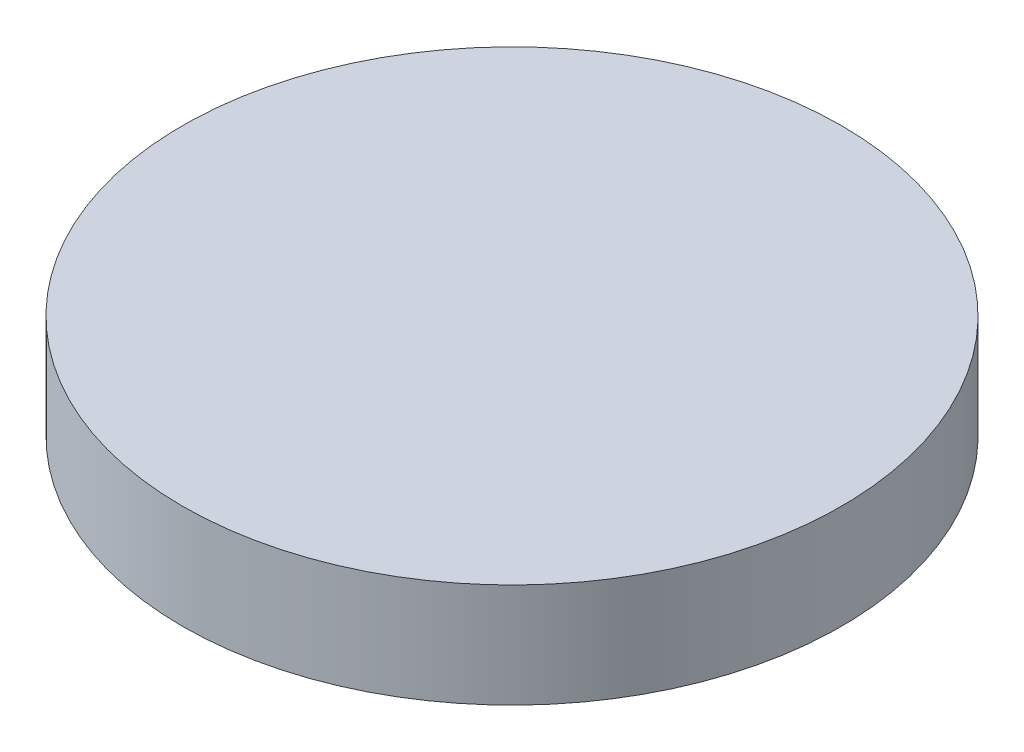
ISO-10303-21;
HEADER;
FILE_DESCRIPTION(('STEP AP214'),'2;1');
FILE_NAME('part.step','',(''),(''),'','','');
FILE_SCHEMA(('AUTOMOTIVE_DESIGN { 1 0 10303 214 1 1 1 1 }'));
ENDSEC;
DATA;
#1=APPLICATION_CONTEXT('core data for automotive mechanical design processes');
#2=APPLICATION_PROTOCOL_DEFINITION('international standard','automotive_design',2000,#1);
#3=PRODUCT_CONTEXT('',#1,'mechanical');
#4=PRODUCT('Part','Part','',(#3));
#5=PRODUCT_RELATED_PRODUCT_CATEGORY('part','',(#4));
#6=PRODUCT_DEFINITION_FORMATION('','',#4);
#7=PRODUCT_DEFINITION_CONTEXT('part definition',#1,'design');
#8=PRODUCT_DEFINITION('design','',#6,#7);
#9=PRODUCT_DEFINITION_SHAPE('','',#8);
#10=(LENGTH_UNIT() NAMED_UNIT(*) SI_UNIT(.MILLI.,.METRE.));
#11=(NAMED_UNIT(*) PLANE_ANGLE_UNIT() SI_UNIT($,.RADIAN.));
#12=(NAMED_UNIT(*) SI_UNIT($,.STERADIAN.) SOLID_ANGLE_UNIT());
#13=UNCERTAINTY_MEASURE_WITH_UNIT(LENGTH_MEASURE(1.E-05),#10,'distance_accuracy_value','');
#14=(GEOMETRIC_REPRESENTATION_CONTEXT(3) GLOBAL_UNCERTAINTY_ASSIGNED_CONTEXT((#13)) GLOBAL_UNIT_ASSIGNED_CONTEXT((#10,
#11,#12)) REPRESENTATION_CONTEXT('',''));
#15=CARTESIAN_POINT('',(0.,0.,0.));
#16=DIRECTION('',(0.,0.,1.));
#17=DIRECTION('',(1.,0.,0.));
#18=AXIS2_PLACEMENT_3D('',#15,#16,#17);
#19=CARTESIAN_POINT('',(0.,19.05,0.));
#20=DIRECTION('',(0.,-1.,0.));
#21=DIRECTION('',(0.,0.,-1.));
#22=AXIS2_PLACEMENT_3D('',#19,#20,#21);
#23=CYLINDRICAL_SURFACE('',#22,60.325);
#24=CARTESIAN_POINT('',(0.,19.05,0.));
#25=DIRECTION('',(0.,1.,0.));
#26=DIRECTION('',(0.,0.,1.));
#27=AXIS2_PLACEMENT_3D('',#24,#25,#26);
#28=CIRCLE('',#27,60.325);
#29=CARTESIAN_POINT('',(0.,19.05,60.325));
#30=VERTEX_POINT('',#29);
#31=EDGE_CURVE('E11',#30,#30,#28,.T.);
#32=ORIENTED_EDGE('',*,*,#31,.F.);
#33=EDGE_LOOP('',(#32));
#34=FACE_BOUND('',#33,.T.);
#35=CARTESIAN_POINT('',(0.,0.,0.));
#36=DIRECTION('',(0.,1.,0.));
#37=DIRECTION('',(0.,0.,1.));
#38=AXIS2_PLACEMENT_3D('',#35,#36,#37);
#39=CIRCLE('',#38,60.325);
#40=CARTESIAN_POINT('',(0.,0.,60.325));
#41=VERTEX_POINT('',#40);
#42=EDGE_CURVE('E37',#41,#41,#39,.T.);
#43=ORIENTED_EDGE('',*,*,#42,.T.);
#44=EDGE_LOOP('',(#43));
#45=FACE_BOUND('',#44,.T.);
#46=ADVANCED_FACE('F34',(#34,#45),#23,.T.);
#47=CARTESIAN_POINT('',(0.,19.05,0.));
#48=DIRECTION('',(0.,1.,0.));
#49=DIRECTION('',(0.,0.,1.));
#50=AXIS2_PLACEMENT_3D('',#47,#48,#49);
#51=PLANE('',#50);
#52=ORIENTED_EDGE('',*,*,#31,.T.);
#53=EDGE_LOOP('',(#52));
#54=FACE_BOUND('',#53,.T.);
#55=ADVANCED_FACE('F129',(#54),#51,.T.);
#56=CARTESIAN_POINT('',(0.,0.,0.));
#57=DIRECTION('',(0.,1.,0.));
#58=DIRECTION('',(0.,0.,1.));
#59=AXIS2_PLACEMENT_3D('',#56,#57,#58);
#60=PLANE('',#59);
#61=CARTESIAN_POINT('',(0.,0.,0.));
#62=DIRECTION('',(0.,-1.,0.));
#63=DIRECTION('',(0.,0.,-1.));
#64=AXIS2_PLACEMENT_3D('',#61,#62,#63);
#65=CIRCLE('',#64,57.15);
#66=CARTESIAN_POINT('',(0.,0.,-57.15));
#67=VERTEX_POINT('',#66);
#68=EDGE_CURVE('E115',#67,#67,#65,.T.);
#69=ORIENTED_EDGE('',*,*,#68,.F.);
#70=EDGE_LOOP('',(#69));
#71=FACE_BOUND('',#70,.T.);
#72=ORIENTED_EDGE('',*,*,#42,.F.);
#73=EDGE_LOOP('',(#72));
#74=FACE_BOUND('',#73,.T.);
#75=ADVANCED_FACE('F126',(#71,#74),#60,.F.);
#76=CARTESIAN_POINT('',(0.,3.175,0.));
#77=DIRECTION('',(0.,-1.,0.));
#78=DIRECTION('',(0.,0.,-1.));
#79=AXIS2_PLACEMENT_3D('',#76,#77,#78);
#80=CYLINDRICAL_SURFACE('',#79,57.15);
#81=CARTESIAN_POINT('',(0.,3.175,0.));
#82=DIRECTION('',(0.,-1.,0.));
#83=DIRECTION('',(0.,0.,-1.));
#84=AXIS2_PLACEMENT_3D('',#81,#82,#83);
#85=CIRCLE('',#84,57.15);
#86=CARTESIAN_POINT('',(0.,3.175,-57.15));
#87=VERTEX_POINT('',#86);
#88=EDGE_CURVE('E118',#87,#87,#85,.T.);
#89=ORIENTED_EDGE('',*,*,#88,.F.);
#90=EDGE_LOOP('',(#89));
#91=FACE_BOUND('',#90,.T.);
#92=ORIENTED_EDGE('',*,*,#68,.T.);
#93=EDGE_LOOP('',(#92));
#94=FACE_BOUND('',#93,.T.);
#95=ADVANCED_FACE('F124',(#91,#94),#80,.F.);
#96=CARTESIAN_POINT('',(0.,3.175,0.));
#97=DIRECTION('',(0.,-1.,0.));
#98=DIRECTION('',(0.,0.,-1.));
#99=AXIS2_PLACEMENT_3D('',#96,#97,#98);
#100=PLANE('',#99);
#101=CARTESIAN_POINT('',(0.,3.175,0.));
#102=DIRECTION('',(0.,-1.,0.));
#103=DIRECTION('',(0.,0.,-1.));
#104=AXIS2_PLACEMENT_3D('',#101,#102,#103);
#105=CIRCLE('',#104,55.5625);
#106=CARTESIAN_POINT('',(0.,3.175,-55.5625));
#107=VERTEX_POINT('',#106);
#108=EDGE_CURVE('E112',#107,#107,#105,.T.);
#109=ORIENTED_EDGE('',*,*,#108,.F.);
#110=EDGE_LOOP('',(#109));
#111=FACE_BOUND('',#110,.T.);
#112=ORIENTED_EDGE('',*,*,#88,.T.);
#113=EDGE_LOOP('',(#112));
#114=FACE_BOUND('',#113,.T.);
#115=ADVANCED_FACE('F147',(#111,#114),#100,.T.);
#116=CARTESIAN_POINT('',(0.,3.175,0.));
#117=DIRECTION('',(0.,-1.,0.));
#118=DIRECTION('',(0.,0.,-1.));
#119=AXIS2_PLACEMENT_3D('',#116,#117,#118);
#120=CYLINDRICAL_SURFACE('',#119,55.5625);
#121=ORIENTED_EDGE('',*,*,#108,.T.);
#122=EDGE_LOOP('',(#121));
#123=FACE_BOUND('',#122,.T.);
#124=CARTESIAN_POINT('',(0.,0.,0.));
#125=DIRECTION('',(0.,-1.,0.));
#126=DIRECTION('',(0.,0.,-1.));
#127=AXIS2_PLACEMENT_3D('',#124,#125,#126);
#128=CIRCLE('',#127,55.5625);
#129=CARTESIAN_POINT('',(0.,0.,-55.5625));
#130=VERTEX_POINT('',#129);
#131=EDGE_CURVE('E109',#130,#130,#128,.T.);
#132=ORIENTED_EDGE('',*,*,#131,.F.);
#133=EDGE_LOOP('',(#132));
#134=FACE_BOUND('',#133,.T.);
#135=ADVANCED_FACE('F151',(#123,#134),#120,.T.);
#136=DIRECTION('',(-1.,0.,0.));
#137=VECTOR('',#136,1.);
#138=CARTESIAN_POINT('',(-4.84861733170483,0.,3.46311504148389));
#139=LINE('',#138,#137);
#140=CARTESIAN_POINT('',(4.84861733170483,0.,3.46311504148389));
#141=VERTEX_POINT('',#140);
#142=CARTESIAN_POINT('',(-4.84861733170483,0.,3.46311504148389));
#143=VERTEX_POINT('',#142);
#144=EDGE_CURVE('E83',#141,#143,#139,.T.);
#145=ORIENTED_EDGE('',*,*,#144,.F.);
#146=DIRECTION('',(0.,0.,1.));
#147=VECTOR('',#146,1.);
#148=CARTESIAN_POINT('',(4.84861733170483,0.,3.46311504148389));
#149=LINE('',#148,#147);
#150=CARTESIAN_POINT('',(4.84861733170483,0.,-3.46311504148389));
#151=VERTEX_POINT('',#150);
#152=EDGE_CURVE('E48',#151,#141,#149,.T.);
#153=ORIENTED_EDGE('',*,*,#152,.F.);
#154=DIRECTION('',(1.,0.,0.));
#155=VECTOR('',#154,1.);
#156=CARTESIAN_POINT('',(-4.84861733170483,0.,-3.46311504148389));
#157=LINE('',#156,#155);
#158=CARTESIAN_POINT('',(-4.84861733170483,0.,-3.46311504148389));
#159=VERTEX_POINT('',#158);
#160=EDGE_CURVE('E99',#159,#151,#157,.T.);
#161=ORIENTED_EDGE('',*,*,#160,.F.);
#162=DIRECTION('',(0.,0.,-1.));
#163=VECTOR('',#162,1.);
#164=CARTESIAN_POINT('',(-4.84861733170483,0.,3.46311504148389));
#165=LINE('',#164,#163);
#166=EDGE_CURVE('E105',#143,#159,#165,.T.);
#167=ORIENTED_EDGE('',*,*,#166,.F.);
#168=EDGE_LOOP('',(#145,#153,#161,#167));
#169=FACE_BOUND('',#168,.T.);
#170=ORIENTED_EDGE('',*,*,#131,.T.);
#171=EDGE_LOOP('',(#170));
#172=FACE_BOUND('',#171,.T.);
#173=ADVANCED_FACE('F130',(#169,#172),#60,.F.);
#174=CARTESIAN_POINT('',(4.84861733170483,2.54,3.46311504148389));
#175=DIRECTION('',(1.,0.,0.));
#176=DIRECTION('',(0.,0.,-1.));
#177=AXIS2_PLACEMENT_3D('',#174,#175,#176);
#178=PLANE('',#177);
#179=ORIENTED_EDGE('',*,*,#152,.T.);
#180=DIRECTION('',(0.,-1.,0.));
#181=VECTOR('',#180,1.);
#182=CARTESIAN_POINT('',(4.84861733170483,2.54,3.46311504148389));
#183=LINE('',#182,#181);
#184=CARTESIAN_POINT('',(4.84861733170483,2.54,3.46311504148389));
#185=VERTEX_POINT('',#184);
#186=EDGE_CURVE('E71',#185,#141,#183,.T.);
#187=ORIENTED_EDGE('',*,*,#186,.F.);
#188=DIRECTION('',(0.,0.,1.));
#189=VECTOR('',#188,1.);
#190=CARTESIAN_POINT('',(4.84861733170483,2.54,3.46311504148389));
#191=LINE('',#190,#189);
#192=CARTESIAN_POINT('',(4.84861733170483,2.54,-3.46311504148389));
#193=VERTEX_POINT('',#192);
#194=EDGE_CURVE('E97',#193,#185,#191,.T.);
#195=ORIENTED_EDGE('',*,*,#194,.F.);
#196=DIRECTION('',(0.,-1.,0.));
#197=VECTOR('',#196,1.);
#198=CARTESIAN_POINT('',(4.84861733170483,2.54,-3.46311504148389));
#199=LINE('',#198,#197);
#200=EDGE_CURVE('E56',#193,#151,#199,.T.);
#201=ORIENTED_EDGE('',*,*,#200,.T.);
#202=EDGE_LOOP('',(#179,#187,#195,#201));
#203=FACE_BOUND('',#202,.T.);
#204=ADVANCED_FACE('F156',(#203),#178,.F.);
#205=CARTESIAN_POINT('',(-4.84861733170483,2.54,-3.46311504148389));
#206=DIRECTION('',(0.,0.,-1.));
#207=DIRECTION('',(-1.,0.,0.));
#208=AXIS2_PLACEMENT_3D('',#205,#206,#207);
#209=PLANE('',#208);
#210=ORIENTED_EDGE('',*,*,#160,.T.);
#211=ORIENTED_EDGE('',*,*,#200,.F.);
#212=DIRECTION('',(1.,0.,0.));
#213=VECTOR('',#212,1.);
#214=CARTESIAN_POINT('',(-4.84861733170483,2.54,-3.46311504148389));
#215=LINE('',#214,#213);
#216=CARTESIAN_POINT('',(-4.84861733170483,2.54,-3.46311504148389));
#217=VERTEX_POINT('',#216);
#218=EDGE_CURVE('E94',#217,#193,#215,.T.);
#219=ORIENTED_EDGE('',*,*,#218,.F.);
#220=DIRECTION('',(0.,-1.,0.));
#221=VECTOR('',#220,1.);
#222=CARTESIAN_POINT('',(-4.84861733170483,2.54,-3.46311504148389));
#223=LINE('',#222,#221);
#224=EDGE_CURVE('E87',#217,#159,#223,.T.);
#225=ORIENTED_EDGE('',*,*,#224,.T.);
#226=EDGE_LOOP('',(#210,#211,#219,#225));
#227=FACE_BOUND('',#226,.T.);
#228=ADVANCED_FACE('F159',(#227),#209,.F.);
#229=CARTESIAN_POINT('',(-4.84861733170483,2.54,3.46311504148389));
#230=DIRECTION('',(-1.,0.,0.));
#231=DIRECTION('',(0.,0.,1.));
#232=AXIS2_PLACEMENT_3D('',#229,#230,#231);
#233=PLANE('',#232);
#234=ORIENTED_EDGE('',*,*,#166,.T.);
#235=ORIENTED_EDGE('',*,*,#224,.F.);
#236=DIRECTION('',(0.,0.,-1.));
#237=VECTOR('',#236,1.);
#238=CARTESIAN_POINT('',(-4.84861733170483,2.54,3.46311504148389));
#239=LINE('',#238,#237);
#240=CARTESIAN_POINT('',(-4.84861733170483,2.54,3.46311504148389));
#241=VERTEX_POINT('',#240);
#242=EDGE_CURVE('E90',#241,#217,#239,.T.);
#243=ORIENTED_EDGE('',*,*,#242,.F.);
#244=DIRECTION('',(0.,-1.,0.));
#245=VECTOR('',#244,1.);
#246=CARTESIAN_POINT('',(-4.84861733170483,2.54,3.46311504148389));
#247=LINE('',#246,#245);
#248=EDGE_CURVE('E76',#241,#143,#247,.T.);
#249=ORIENTED_EDGE('',*,*,#248,.T.);
#250=EDGE_LOOP('',(#234,#235,#243,#249));
#251=FACE_BOUND('',#250,.T.);
#252=ADVANCED_FACE('F91',(#251),#233,.F.);
#253=CARTESIAN_POINT('',(-4.84861733170483,2.54,3.46311504148389));
#254=DIRECTION('',(0.,0.,1.));
#255=DIRECTION('',(1.,0.,0.));
#256=AXIS2_PLACEMENT_3D('',#253,#254,#255);
#257=PLANE('',#256);
#258=ORIENTED_EDGE('',*,*,#144,.T.);
#259=ORIENTED_EDGE('',*,*,#248,.F.);
#260=DIRECTION('',(-1.,0.,0.));
#261=VECTOR('',#260,1.);
#262=CARTESIAN_POINT('',(-4.84861733170483,2.54,3.46311504148389));
#263=LINE('',#262,#261);
#264=EDGE_CURVE('E80',#185,#241,#263,.T.);
#265=ORIENTED_EDGE('',*,*,#264,.F.);
#266=ORIENTED_EDGE('',*,*,#186,.T.);
#267=EDGE_LOOP('',(#258,#259,#265,#266));
#268=FACE_BOUND('',#267,.T.);
#269=ADVANCED_FACE('F78',(#268),#257,.F.);
#270=CARTESIAN_POINT('',(0.,2.54,0.));
#271=DIRECTION('',(0.,-1.,0.));
#272=DIRECTION('',(0.,0.,-1.));
#273=AXIS2_PLACEMENT_3D('',#270,#271,#272);
#274=PLANE('',#273);
#275=ORIENTED_EDGE('',*,*,#194,.T.);
#276=ORIENTED_EDGE('',*,*,#264,.T.);
#277=ORIENTED_EDGE('',*,*,#242,.T.);
#278=ORIENTED_EDGE('',*,*,#218,.T.);
#279=EDGE_LOOP('',(#275,#276,#277,#278));
#280=FACE_BOUND('',#279,.T.);
#281=ADVANCED_FACE('F96',(#280),#274,.T.);
#282=CLOSED_SHELL('',(#46,#55,#75,#95,#115,#135,#173,#204,#228,#252,#269,#281));
#283=MANIFOLD_SOLID_BREP('B2',#282);
#284=ADVANCED_BREP_SHAPE_REPRESENTATION('',(#18,#283),#14);
#285=SHAPE_DEFINITION_REPRESENTATION(#9,#284);
ENDSEC;
END-ISO-10303-21;
